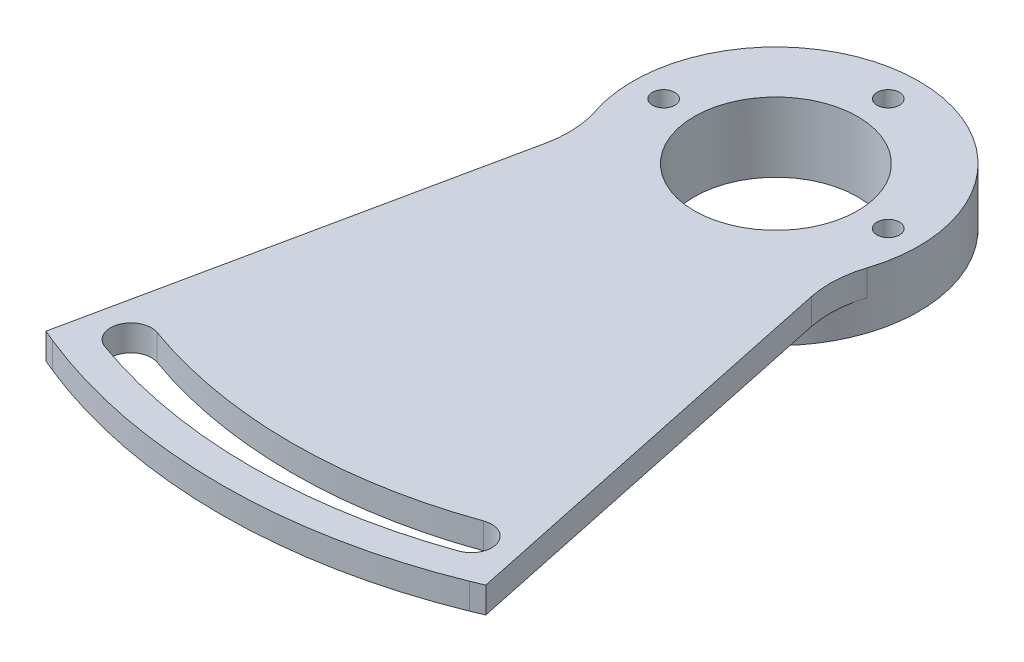
ISO-10303-21;
HEADER;
FILE_DESCRIPTION(('STEP AP214'),'2;1');
FILE_NAME('part.step','',(''),(''),'','','');
FILE_SCHEMA(('AUTOMOTIVE_DESIGN { 1 0 10303 214 1 1 1 1 }'));
ENDSEC;
DATA;
#1=APPLICATION_CONTEXT('core data for automotive mechanical design processes');
#2=APPLICATION_PROTOCOL_DEFINITION('international standard','automotive_design',2000,#1);
#3=PRODUCT_CONTEXT('',#1,'mechanical');
#4=PRODUCT('Part','Part','',(#3));
#5=PRODUCT_RELATED_PRODUCT_CATEGORY('part','',(#4));
#6=PRODUCT_DEFINITION_FORMATION('','',#4);
#7=PRODUCT_DEFINITION_CONTEXT('part definition',#1,'design');
#8=PRODUCT_DEFINITION('design','',#6,#7);
#9=PRODUCT_DEFINITION_SHAPE('','',#8);
#10=(LENGTH_UNIT() NAMED_UNIT(*) SI_UNIT(.MILLI.,.METRE.));
#11=(NAMED_UNIT(*) PLANE_ANGLE_UNIT() SI_UNIT($,.RADIAN.));
#12=(NAMED_UNIT(*) SI_UNIT($,.STERADIAN.) SOLID_ANGLE_UNIT());
#13=UNCERTAINTY_MEASURE_WITH_UNIT(LENGTH_MEASURE(1.E-05),#10,'distance_accuracy_value','');
#14=(GEOMETRIC_REPRESENTATION_CONTEXT(3) GLOBAL_UNCERTAINTY_ASSIGNED_CONTEXT((#13)) GLOBAL_UNIT_ASSIGNED_CONTEXT((#10,
#11,#12)) REPRESENTATION_CONTEXT('',''));
#15=CARTESIAN_POINT('',(0.,0.,0.));
#16=DIRECTION('',(0.,0.,1.));
#17=DIRECTION('',(1.,0.,0.));
#18=AXIS2_PLACEMENT_3D('',#15,#16,#17);
#19=CARTESIAN_POINT('',(0.,-2.999994,0.));
#20=DIRECTION('',(0.,1.,0.));
#21=DIRECTION('',(0.,0.,1.));
#22=AXIS2_PLACEMENT_3D('',#19,#20,#21);
#23=PLANE('',#22);
#24=CARTESIAN_POINT('',(0.,-2.999994,9.72130000166609));
#25=DIRECTION('',(0.,1.,0.));
#26=DIRECTION('',(0.,0.,1.));
#27=AXIS2_PLACEMENT_3D('',#24,#25,#26);
#28=CIRCLE('',#27,14.);
#29=CARTESIAN_POINT('',(0.,-2.999994,23.7213000016661));
#30=VERTEX_POINT('',#29);
#31=EDGE_CURVE('E254',#30,#30,#28,.T.);
#32=ORIENTED_EDGE('',*,*,#31,.F.);
#33=EDGE_LOOP('',(#32));
#34=FACE_BOUND('',#33,.T.);
#35=CARTESIAN_POINT('',(0.,-2.999994,-1.27869999833391));
#36=DIRECTION('',(0.,1.,0.));
#37=DIRECTION('',(0.,0.,1.));
#38=AXIS2_PLACEMENT_3D('',#35,#36,#37);
#39=CIRCLE('',#38,1.1);
#40=CARTESIAN_POINT('',(0.,-2.999994,-0.178699998333911));
#41=VERTEX_POINT('',#40);
#42=EDGE_CURVE('E336',#41,#41,#39,.T.);
#43=ORIENTED_EDGE('',*,*,#42,.T.);
#44=EDGE_LOOP('',(#43));
#45=FACE_BOUND('',#44,.T.);
#46=CARTESIAN_POINT('',(11.,-2.999994,9.72130000166609));
#47=DIRECTION('',(0.,1.,0.));
#48=DIRECTION('',(0.,0.,1.));
#49=AXIS2_PLACEMENT_3D('',#46,#47,#48);
#50=CIRCLE('',#49,1.1);
#51=CARTESIAN_POINT('',(11.,-2.999994,10.8213000016661));
#52=VERTEX_POINT('',#51);
#53=EDGE_CURVE('E333',#52,#52,#50,.T.);
#54=ORIENTED_EDGE('',*,*,#53,.T.);
#55=EDGE_LOOP('',(#54));
#56=FACE_BOUND('',#55,.T.);
#57=CARTESIAN_POINT('',(-11.,-2.999994,9.7213000016661));
#58=DIRECTION('',(0.,1.,0.));
#59=DIRECTION('',(0.,0.,1.));
#60=AXIS2_PLACEMENT_3D('',#57,#58,#59);
#61=CIRCLE('',#60,1.09999999999999);
#62=CARTESIAN_POINT('',(-11.,-2.999994,10.8213000016661));
#63=VERTEX_POINT('',#62);
#64=EDGE_CURVE('E328',#63,#63,#61,.T.);
#65=ORIENTED_EDGE('',*,*,#64,.T.);
#66=EDGE_LOOP('',(#65));
#67=FACE_BOUND('',#66,.T.);
#68=CARTESIAN_POINT('',(0.,-2.999994,9.72130000166609));
#69=DIRECTION('',(0.,1.,0.));
#70=DIRECTION('',(0.,0.,1.));
#71=AXIS2_PLACEMENT_3D('',#68,#69,#70);
#72=CIRCLE('',#71,9.);
#73=CARTESIAN_POINT('',(0.,-2.999994,18.7213000016661));
#74=VERTEX_POINT('',#73);
#75=EDGE_CURVE('E11',#74,#74,#72,.F.);
#76=ORIENTED_EDGE('',*,*,#75,.F.);
#77=EDGE_LOOP('',(#76));
#78=FACE_BOUND('',#77,.T.);
#79=ADVANCED_FACE('F34',(#34,#45,#56,#67,#78),#23,.F.);
#80=CARTESIAN_POINT('',(0.,2.54,9.72130000166609));
#81=DIRECTION('',(0.,-1.,0.));
#82=DIRECTION('',(0.,0.,-1.));
#83=AXIS2_PLACEMENT_3D('',#80,#81,#82);
#84=CYLINDRICAL_SURFACE('',#83,14.);
#85=DIRECTION('',(0.,-1.,0.));
#86=VECTOR('',#85,1.);
#87=CARTESIAN_POINT('',(13.3002264531034,2.54,14.0921095715476));
#88=LINE('',#87,#86);
#89=CARTESIAN_POINT('',(13.3002264531034,2.54,14.0921095715476));
#90=VERTEX_POINT('',#89);
#91=CARTESIAN_POINT('',(13.3002264531034,0.,14.0921095715476));
#92=VERTEX_POINT('',#91);
#93=EDGE_CURVE('E132',#90,#92,#88,.T.);
#94=ORIENTED_EDGE('',*,*,#93,.T.);
#95=CARTESIAN_POINT('',(0.,0.,9.72130000166609));
#96=DIRECTION('',(0.,1.,0.));
#97=DIRECTION('',(0.,0.,1.));
#98=AXIS2_PLACEMENT_3D('',#95,#96,#97);
#99=CIRCLE('',#98,14.);
#100=CARTESIAN_POINT('',(-13.3002264531034,0.,14.0921095715476));
#101=VERTEX_POINT('',#100);
#102=EDGE_CURVE('E42',#101,#92,#99,.T.);
#103=ORIENTED_EDGE('',*,*,#102,.F.);
#104=DIRECTION('',(0.,-1.,0.));
#105=VECTOR('',#104,1.);
#106=CARTESIAN_POINT('',(-13.3002264531034,2.54,14.0921095715476));
#107=LINE('',#106,#105);
#108=CARTESIAN_POINT('',(-13.3002264531034,2.54,14.0921095715476));
#109=VERTEX_POINT('',#108);
#110=EDGE_CURVE('E129',#101,#109,#107,.F.);
#111=ORIENTED_EDGE('',*,*,#110,.T.);
#112=CARTESIAN_POINT('',(0.,2.54,9.72130000166609));
#113=DIRECTION('',(0.,1.,0.));
#114=DIRECTION('',(0.,0.,1.));
#115=AXIS2_PLACEMENT_3D('',#112,#113,#114);
#116=CIRCLE('',#115,14.);
#117=EDGE_CURVE('E158',#90,#109,#116,.T.);
#118=ORIENTED_EDGE('',*,*,#117,.F.);
#119=EDGE_LOOP('',(#94,#103,#111,#118));
#120=FACE_BOUND('',#119,.T.);
#121=ORIENTED_EDGE('',*,*,#31,.T.);
#122=EDGE_LOOP('',(#121));
#123=FACE_BOUND('',#122,.T.);
#124=ADVANCED_FACE('F125',(#120,#123),#84,.T.);
#125=CARTESIAN_POINT('',(-8.56841564748164,2.54,-1.80723900880772));
#126=DIRECTION('',(0.978472319325836,0.,0.20637810037191));
#127=DIRECTION('',(0.20637810037191,0.,-0.978472319325837));
#128=AXIS2_PLACEMENT_3D('',#125,#126,#127);
#129=PLANE('',#128);
#130=DIRECTION('',(-0.20637810037191,0.,0.978472319325837));
#131=VECTOR('',#130,1.);
#132=CARTESIAN_POINT('',(-8.56841564748164,2.54,-1.80723900880772));
#133=LINE('',#132,#131);
#134=CARTESIAN_POINT('',(-13.0156650120618,2.54,19.2778974108964));
#135=VERTEX_POINT('',#134);
#136=CARTESIAN_POINT('',(-21.5361568841167,2.54,59.6749425858563));
#137=VERTEX_POINT('',#136);
#138=EDGE_CURVE('E162',#135,#137,#133,.T.);
#139=ORIENTED_EDGE('',*,*,#138,.F.);
#140=DIRECTION('',(0.,1.,0.));
#141=VECTOR('',#140,1.);
#142=CARTESIAN_POINT('',(-13.0156650120618,0.,19.2778974108964));
#143=LINE('',#142,#141);
#144=CARTESIAN_POINT('',(-13.0156650120618,0.,19.2778974108964));
#145=VERTEX_POINT('',#144);
#146=EDGE_CURVE('E149',#135,#145,#143,.F.);
#147=ORIENTED_EDGE('',*,*,#146,.T.);
#148=DIRECTION('',(-0.20637810037191,0.,0.978472319325837));
#149=VECTOR('',#148,1.);
#150=CARTESIAN_POINT('',(-8.56841564748164,0.,-1.80723900880772));
#151=LINE('',#150,#149);
#152=CARTESIAN_POINT('',(-21.5361568841167,0.,59.6749425858563));
#153=VERTEX_POINT('',#152);
#154=EDGE_CURVE('E139',#145,#153,#151,.T.);
#155=ORIENTED_EDGE('',*,*,#154,.T.);
#156=DIRECTION('',(0.,-1.,0.));
#157=VECTOR('',#156,1.);
#158=CARTESIAN_POINT('',(-21.5361568841167,2.54,59.6749425858563));
#159=LINE('',#158,#157);
#160=EDGE_CURVE('E285',#137,#153,#159,.T.);
#161=ORIENTED_EDGE('',*,*,#160,.F.);
#162=EDGE_LOOP('',(#139,#147,#155,#161));
#163=FACE_BOUND('',#162,.T.);
#164=ADVANCED_FACE('F180',(#163),#129,.F.);
#165=CARTESIAN_POINT('',(-24.43214967919,2.54,58.4647199158263));
#166=DIRECTION('',(0.38558134753756,0.,-0.922673845099729));
#167=DIRECTION('',(-0.922673845099729,0.,-0.38558134753756));
#168=AXIS2_PLACEMENT_3D('',#165,#166,#167);
#169=PLANE('',#168);
#170=DIRECTION('',(0.922673845099729,0.,0.38558134753756));
#171=VECTOR('',#170,1.);
#172=CARTESIAN_POINT('',(-24.43214967919,0.,58.4647199158263));
#173=LINE('',#172,#171);
#174=CARTESIAN_POINT('',(-20.4111298530471,0.,60.1450864410873));
#175=VERTEX_POINT('',#174);
#176=EDGE_CURVE('E267',#153,#175,#173,.T.);
#177=ORIENTED_EDGE('',*,*,#176,.T.);
#178=DIRECTION('',(0.,-1.,0.));
#179=VECTOR('',#178,1.);
#180=CARTESIAN_POINT('',(-20.4111298530471,2.54,60.1450864410873));
#181=LINE('',#180,#179);
#182=CARTESIAN_POINT('',(-20.4111298530471,2.54,60.1450864410873));
#183=VERTEX_POINT('',#182);
#184=EDGE_CURVE('E283',#183,#175,#181,.T.);
#185=ORIENTED_EDGE('',*,*,#184,.F.);
#186=DIRECTION('',(0.922673845099729,0.,0.38558134753756));
#187=VECTOR('',#186,1.);
#188=CARTESIAN_POINT('',(-24.43214967919,2.54,58.4647199158263));
#189=LINE('',#188,#187);
#190=EDGE_CURVE('E297',#137,#183,#189,.T.);
#191=ORIENTED_EDGE('',*,*,#190,.F.);
#192=ORIENTED_EDGE('',*,*,#160,.T.);
#193=EDGE_LOOP('',(#177,#185,#191,#192));
#194=FACE_BOUND('',#193,.T.);
#195=ADVANCED_FACE('F221',(#194),#169,.F.);
#196=CARTESIAN_POINT('',(0.,2.54,9.72130000166609));
#197=DIRECTION('',(0.,-1.,0.));
#198=DIRECTION('',(0.,0.,-1.));
#199=AXIS2_PLACEMENT_3D('',#196,#197,#198);
#200=CYLINDRICAL_SURFACE('',#199,54.3982762664986);
#201=CARTESIAN_POINT('',(0.,0.,9.72130000166609));
#202=DIRECTION('',(0.,1.,0.));
#203=DIRECTION('',(0.,0.,1.));
#204=AXIS2_PLACEMENT_3D('',#201,#202,#203);
#205=CIRCLE('',#204,54.3982762664986);
#206=CARTESIAN_POINT('',(20.4111298530471,0.,60.1450864410873));
#207=VERTEX_POINT('',#206);
#208=EDGE_CURVE('E270',#207,#175,#205,.F.);
#209=ORIENTED_EDGE('',*,*,#208,.F.);
#210=DIRECTION('',(0.,-1.,0.));
#211=VECTOR('',#210,1.);
#212=CARTESIAN_POINT('',(20.4111298530471,2.54,60.1450864410873));
#213=LINE('',#212,#211);
#214=CARTESIAN_POINT('',(20.4111298530471,2.54,60.1450864410873));
#215=VERTEX_POINT('',#214);
#216=EDGE_CURVE('E281',#215,#207,#213,.T.);
#217=ORIENTED_EDGE('',*,*,#216,.F.);
#218=CARTESIAN_POINT('',(0.,2.54,9.72130000166609));
#219=DIRECTION('',(0.,1.,0.));
#220=DIRECTION('',(0.,0.,1.));
#221=AXIS2_PLACEMENT_3D('',#218,#219,#220);
#222=CIRCLE('',#221,54.3982762664986);
#223=EDGE_CURVE('E299',#215,#183,#222,.F.);
#224=ORIENTED_EDGE('',*,*,#223,.T.);
#225=ORIENTED_EDGE('',*,*,#184,.T.);
#226=EDGE_LOOP('',(#209,#217,#224,#225));
#227=FACE_BOUND('',#226,.T.);
#228=ADVANCED_FACE('F217',(#227),#200,.T.);
#229=CARTESIAN_POINT('',(24.4321496791903,2.54,58.4647199158262));
#230=DIRECTION('',(0.385581347537565,0.,0.922673845099727));
#231=DIRECTION('',(0.922673845099727,0.,-0.385581347537565));
#232=AXIS2_PLACEMENT_3D('',#229,#230,#231);
#233=PLANE('',#232);
#234=DIRECTION('',(-0.922673845099727,0.,0.385581347537565));
#235=VECTOR('',#234,1.);
#236=CARTESIAN_POINT('',(24.4321496791903,0.,58.4647199158262));
#237=LINE('',#236,#235);
#238=CARTESIAN_POINT('',(21.5361568841167,0.,59.6749425858563));
#239=VERTEX_POINT('',#238);
#240=EDGE_CURVE('E273',#239,#207,#237,.T.);
#241=ORIENTED_EDGE('',*,*,#240,.F.);
#242=DIRECTION('',(0.,-1.,0.));
#243=VECTOR('',#242,1.);
#244=CARTESIAN_POINT('',(21.5361568841167,2.54,59.6749425858563));
#245=LINE('',#244,#243);
#246=CARTESIAN_POINT('',(21.5361568841167,2.54,59.6749425858563));
#247=VERTEX_POINT('',#246);
#248=EDGE_CURVE('E279',#247,#239,#245,.T.);
#249=ORIENTED_EDGE('',*,*,#248,.F.);
#250=DIRECTION('',(-0.922673845099727,0.,0.385581347537565));
#251=VECTOR('',#250,1.);
#252=CARTESIAN_POINT('',(24.4321496791903,2.54,58.4647199158262));
#253=LINE('',#252,#251);
#254=EDGE_CURVE('E305',#247,#215,#253,.T.);
#255=ORIENTED_EDGE('',*,*,#254,.T.);
#256=ORIENTED_EDGE('',*,*,#216,.T.);
#257=EDGE_LOOP('',(#241,#249,#255,#256));
#258=FACE_BOUND('',#257,.T.);
#259=ADVANCED_FACE('F213',(#258),#233,.T.);
#260=CARTESIAN_POINT('',(0.,2.54,9.72130000166609));
#261=DIRECTION('',(0.,-1.,0.));
#262=DIRECTION('',(0.,0.,-1.));
#263=AXIS2_PLACEMENT_3D('',#260,#261,#262);
#264=CYLINDRICAL_SURFACE('',#263,51.3982762885047);
#265=CARTESIAN_POINT('',(0.,0.,9.72130000166609));
#266=DIRECTION('',(0.,1.,0.));
#267=DIRECTION('',(0.,0.,1.));
#268=AXIS2_PLACEMENT_3D('',#265,#266,#267);
#269=CIRCLE('',#268,51.3982762885047);
#270=CARTESIAN_POINT('',(-17.3407347640808,0.,58.1060261378267));
#271=VERTEX_POINT('',#270);
#272=CARTESIAN_POINT('',(17.340734764081,0.,58.1060261378267));
#273=VERTEX_POINT('',#272);
#274=EDGE_CURVE('E245',#271,#273,#269,.T.);
#275=ORIENTED_EDGE('',*,*,#274,.F.);
#276=DIRECTION('',(0.,-1.,0.));
#277=VECTOR('',#276,1.);
#278=CARTESIAN_POINT('',(-17.3407347640808,2.54,58.1060261378267));
#279=LINE('',#278,#277);
#280=CARTESIAN_POINT('',(-17.3407347640808,2.54,58.1060261378267));
#281=VERTEX_POINT('',#280);
#282=EDGE_CURVE('E248',#281,#271,#279,.T.);
#283=ORIENTED_EDGE('',*,*,#282,.F.);
#284=CARTESIAN_POINT('',(0.,2.54,9.72130000166609));
#285=DIRECTION('',(0.,1.,0.));
#286=DIRECTION('',(0.,0.,1.));
#287=AXIS2_PLACEMENT_3D('',#284,#285,#286);
#288=CIRCLE('',#287,51.3982762885047);
#289=CARTESIAN_POINT('',(17.340734764081,2.54,58.1060261378267));
#290=VERTEX_POINT('',#289);
#291=EDGE_CURVE('E278',#281,#290,#288,.T.);
#292=ORIENTED_EDGE('',*,*,#291,.T.);
#293=DIRECTION('',(0.,-1.,0.));
#294=VECTOR('',#293,1.);
#295=CARTESIAN_POINT('',(17.340734764081,2.54,58.1060261378267));
#296=LINE('',#295,#294);
#297=EDGE_CURVE('E250',#290,#273,#296,.T.);
#298=ORIENTED_EDGE('',*,*,#297,.T.);
#299=EDGE_LOOP('',(#275,#283,#292,#298));
#300=FACE_BOUND('',#299,.T.);
#301=ADVANCED_FACE('F216',(#300),#264,.F.);
#302=CARTESIAN_POINT('',(-16.6659753937199,2.54,56.2232888843658));
#303=DIRECTION('',(0.,-1.,0.));
#304=DIRECTION('',(0.,0.,-1.));
#305=AXIS2_PLACEMENT_3D('',#302,#303,#304);
#306=CYLINDRICAL_SURFACE('',#305,1.99999994336487);
#307=CARTESIAN_POINT('',(-16.6659753937199,0.,56.2232888843658));
#308=DIRECTION('',(0.,1.,0.));
#309=DIRECTION('',(0.,0.,1.));
#310=AXIS2_PLACEMENT_3D('',#307,#308,#309);
#311=CIRCLE('',#310,1.99999994336487);
#312=CARTESIAN_POINT('',(-15.991216023359,0.,54.3405516309048));
#313=VERTEX_POINT('',#312);
#314=EDGE_CURVE('E253',#313,#271,#311,.T.);
#315=ORIENTED_EDGE('',*,*,#314,.F.);
#316=DIRECTION('',(0.,-1.,0.));
#317=VECTOR('',#316,1.);
#318=CARTESIAN_POINT('',(-15.991216023359,2.54,54.3405516309048));
#319=LINE('',#318,#317);
#320=CARTESIAN_POINT('',(-15.991216023359,2.54,54.3405516309048));
#321=VERTEX_POINT('',#320);
#322=EDGE_CURVE('E292',#321,#313,#319,.T.);
#323=ORIENTED_EDGE('',*,*,#322,.F.);
#324=CARTESIAN_POINT('',(-16.6659753937199,2.54,56.2232888843658));
#325=DIRECTION('',(0.,1.,0.));
#326=DIRECTION('',(0.,0.,1.));
#327=AXIS2_PLACEMENT_3D('',#324,#325,#326);
#328=CIRCLE('',#327,1.99999994336487);
#329=EDGE_CURVE('E342',#321,#281,#328,.T.);
#330=ORIENTED_EDGE('',*,*,#329,.T.);
#331=ORIENTED_EDGE('',*,*,#282,.T.);
#332=EDGE_LOOP('',(#315,#323,#330,#331));
#333=FACE_BOUND('',#332,.T.);
#334=ADVANCED_FACE('F234',(#333),#306,.F.);
#335=CARTESIAN_POINT('',(0.,2.54,9.72130000166609));
#336=DIRECTION('',(0.,-1.,0.));
#337=DIRECTION('',(0.,0.,-1.));
#338=AXIS2_PLACEMENT_3D('',#335,#336,#337);
#339=CYLINDRICAL_SURFACE('',#338,47.398276401775);
#340=CARTESIAN_POINT('',(0.,0.,9.72130000166609));
#341=DIRECTION('',(0.,1.,0.));
#342=DIRECTION('',(0.,0.,1.));
#343=AXIS2_PLACEMENT_3D('',#340,#341,#342);
#344=CIRCLE('',#343,47.398276401775);
#345=CARTESIAN_POINT('',(15.9912160233592,0.,54.3405516309047));
#346=VERTEX_POINT('',#345);
#347=EDGE_CURVE('E259',#346,#313,#344,.F.);
#348=ORIENTED_EDGE('',*,*,#347,.F.);
#349=DIRECTION('',(0.,-1.,0.));
#350=VECTOR('',#349,1.);
#351=CARTESIAN_POINT('',(15.9912160233592,2.54,54.3405516309047));
#352=LINE('',#351,#350);
#353=CARTESIAN_POINT('',(15.9912160233592,2.54,54.3405516309047));
#354=VERTEX_POINT('',#353);
#355=EDGE_CURVE('E289',#354,#346,#352,.T.);
#356=ORIENTED_EDGE('',*,*,#355,.F.);
#357=CARTESIAN_POINT('',(0.,2.54,9.72130000166609));
#358=DIRECTION('',(0.,1.,0.));
#359=DIRECTION('',(0.,0.,1.));
#360=AXIS2_PLACEMENT_3D('',#357,#358,#359);
#361=CIRCLE('',#360,47.398276401775);
#362=EDGE_CURVE('E345',#354,#321,#361,.F.);
#363=ORIENTED_EDGE('',*,*,#362,.T.);
#364=ORIENTED_EDGE('',*,*,#322,.T.);
#365=EDGE_LOOP('',(#348,#356,#363,#364));
#366=FACE_BOUND('',#365,.T.);
#367=ADVANCED_FACE('F201',(#366),#339,.T.);
#368=CARTESIAN_POINT('',(0.,2.54,-1.27869999833391));
#369=DIRECTION('',(0.,-1.,0.));
#370=DIRECTION('',(0.,0.,-1.));
#371=AXIS2_PLACEMENT_3D('',#368,#369,#370);
#372=CYLINDRICAL_SURFACE('',#371,1.1);
#373=CARTESIAN_POINT('',(0.,2.54,-1.27869999833391));
#374=DIRECTION('',(0.,1.,0.));
#375=DIRECTION('',(0.,0.,1.));
#376=AXIS2_PLACEMENT_3D('',#373,#374,#375);
#377=CIRCLE('',#376,1.1);
#378=CARTESIAN_POINT('',(0.,2.54,-0.178699998333911));
#379=VERTEX_POINT('',#378);
#380=EDGE_CURVE('E315',#379,#379,#377,.T.);
#381=ORIENTED_EDGE('',*,*,#380,.T.);
#382=EDGE_LOOP('',(#381));
#383=FACE_BOUND('',#382,.T.);
#384=ORIENTED_EDGE('',*,*,#42,.F.);
#385=EDGE_LOOP('',(#384));
#386=FACE_BOUND('',#385,.T.);
#387=ADVANCED_FACE('F197',(#383,#386),#372,.F.);
#388=CARTESIAN_POINT('',(11.,2.54,9.72130000166609));
#389=DIRECTION('',(0.,-1.,0.));
#390=DIRECTION('',(0.,0.,-1.));
#391=AXIS2_PLACEMENT_3D('',#388,#389,#390);
#392=CYLINDRICAL_SURFACE('',#391,1.1);
#393=CARTESIAN_POINT('',(11.,2.54,9.72130000166609));
#394=DIRECTION('',(0.,1.,0.));
#395=DIRECTION('',(0.,0.,1.));
#396=AXIS2_PLACEMENT_3D('',#393,#394,#395);
#397=CIRCLE('',#396,1.1);
#398=CARTESIAN_POINT('',(11.,2.54,10.8213000016661));
#399=VERTEX_POINT('',#398);
#400=EDGE_CURVE('E312',#399,#399,#397,.T.);
#401=ORIENTED_EDGE('',*,*,#400,.T.);
#402=EDGE_LOOP('',(#401));
#403=FACE_BOUND('',#402,.T.);
#404=ORIENTED_EDGE('',*,*,#53,.F.);
#405=EDGE_LOOP('',(#404));
#406=FACE_BOUND('',#405,.T.);
#407=ADVANCED_FACE('F200',(#403,#406),#392,.F.);
#408=CARTESIAN_POINT('',(-11.,2.54,9.7213000016661));
#409=DIRECTION('',(0.,-1.,0.));
#410=DIRECTION('',(0.,0.,-1.));
#411=AXIS2_PLACEMENT_3D('',#408,#409,#410);
#412=CYLINDRICAL_SURFACE('',#411,1.09999999999999);
#413=CARTESIAN_POINT('',(-11.,2.54,9.7213000016661));
#414=DIRECTION('',(0.,1.,0.));
#415=DIRECTION('',(0.,0.,1.));
#416=AXIS2_PLACEMENT_3D('',#413,#414,#415);
#417=CIRCLE('',#416,1.09999999999999);
#418=CARTESIAN_POINT('',(-11.,2.54,10.8213000016661));
#419=VERTEX_POINT('',#418);
#420=EDGE_CURVE('E309',#419,#419,#417,.T.);
#421=ORIENTED_EDGE('',*,*,#420,.T.);
#422=EDGE_LOOP('',(#421));
#423=FACE_BOUND('',#422,.T.);
#424=ORIENTED_EDGE('',*,*,#64,.F.);
#425=EDGE_LOOP('',(#424));
#426=FACE_BOUND('',#425,.T.);
#427=ADVANCED_FACE('F205',(#423,#426),#412,.F.);
#428=CARTESIAN_POINT('',(8.56841564748165,2.54,-1.80723900880772));
#429=DIRECTION('',(-0.978472319325837,0.,0.20637810037191));
#430=DIRECTION('',(0.20637810037191,0.,0.978472319325837));
#431=AXIS2_PLACEMENT_3D('',#428,#429,#430);
#432=PLANE('',#431);
#433=DIRECTION('',(-0.20637810037191,0.,-0.978472319325837));
#434=VECTOR('',#433,1.);
#435=CARTESIAN_POINT('',(8.56841564748165,0.,-1.80723900880772));
#436=LINE('',#435,#434);
#437=CARTESIAN_POINT('',(13.0156650120618,0.,19.2778974108963));
#438=VERTEX_POINT('',#437);
#439=EDGE_CURVE('E276',#239,#438,#436,.T.);
#440=ORIENTED_EDGE('',*,*,#439,.T.);
#441=DIRECTION('',(0.,1.,0.));
#442=VECTOR('',#441,1.);
#443=CARTESIAN_POINT('',(13.0156650120618,2.54,19.2778974108963));
#444=LINE('',#443,#442);
#445=CARTESIAN_POINT('',(13.0156650120618,2.54,19.2778974108963));
#446=VERTEX_POINT('',#445);
#447=EDGE_CURVE('E49',#438,#446,#444,.T.);
#448=ORIENTED_EDGE('',*,*,#447,.T.);
#449=DIRECTION('',(-0.20637810037191,0.,-0.978472319325837));
#450=VECTOR('',#449,1.);
#451=CARTESIAN_POINT('',(8.56841564748165,2.54,-1.80723900880772));
#452=LINE('',#451,#450);
#453=EDGE_CURVE('E160',#247,#446,#452,.T.);
#454=ORIENTED_EDGE('',*,*,#453,.F.);
#455=ORIENTED_EDGE('',*,*,#248,.T.);
#456=EDGE_LOOP('',(#440,#448,#454,#455));
#457=FACE_BOUND('',#456,.T.);
#458=ADVANCED_FACE('F209',(#457),#432,.F.);
#459=CARTESIAN_POINT('',(16.6659753937201,2.54,56.2232888843657));
#460=DIRECTION('',(0.,-1.,0.));
#461=DIRECTION('',(0.,0.,-1.));
#462=AXIS2_PLACEMENT_3D('',#459,#460,#461);
#463=CYLINDRICAL_SURFACE('',#462,1.99999994336488);
#464=CARTESIAN_POINT('',(16.6659753937201,0.,56.2232888843657));
#465=DIRECTION('',(0.,1.,0.));
#466=DIRECTION('',(0.,0.,1.));
#467=AXIS2_PLACEMENT_3D('',#464,#465,#466);
#468=CIRCLE('',#467,1.99999994336488);
#469=EDGE_CURVE('E261',#273,#346,#468,.T.);
#470=ORIENTED_EDGE('',*,*,#469,.F.);
#471=ORIENTED_EDGE('',*,*,#297,.F.);
#472=CARTESIAN_POINT('',(16.6659753937201,2.54,56.2232888843657));
#473=DIRECTION('',(0.,1.,0.));
#474=DIRECTION('',(0.,0.,1.));
#475=AXIS2_PLACEMENT_3D('',#472,#473,#474);
#476=CIRCLE('',#475,1.99999994336488);
#477=EDGE_CURVE('E163',#290,#354,#476,.T.);
#478=ORIENTED_EDGE('',*,*,#477,.T.);
#479=ORIENTED_EDGE('',*,*,#355,.T.);
#480=EDGE_LOOP('',(#470,#471,#478,#479));
#481=FACE_BOUND('',#480,.T.);
#482=ADVANCED_FACE('F195',(#481),#463,.F.);
#483=CARTESIAN_POINT('',(0.,2.54,9.72130000166609));
#484=DIRECTION('',(0.,-1.,0.));
#485=DIRECTION('',(0.,0.,-1.));
#486=AXIS2_PLACEMENT_3D('',#483,#484,#485);
#487=CYLINDRICAL_SURFACE('',#486,8.00000000000001);
#488=CARTESIAN_POINT('',(0.,2.54,9.72130000166609));
#489=DIRECTION('',(0.,1.,0.));
#490=DIRECTION('',(0.,0.,1.));
#491=AXIS2_PLACEMENT_3D('',#488,#489,#490);
#492=CIRCLE('',#491,8.00000000000001);
#493=CARTESIAN_POINT('',(0.,2.54,17.7213000016661));
#494=VERTEX_POINT('',#493);
#495=EDGE_CURVE('E290',#494,#494,#492,.F.);
#496=ORIENTED_EDGE('',*,*,#495,.F.);
#497=EDGE_LOOP('',(#496));
#498=FACE_BOUND('',#497,.T.);
#499=CARTESIAN_POINT('',(0.,-4.269994,9.72130000166609));
#500=DIRECTION('',(0.,-1.,0.));
#501=DIRECTION('',(0.,0.,-1.));
#502=AXIS2_PLACEMENT_3D('',#499,#500,#501);
#503=CIRCLE('',#502,8.00000000000001);
#504=CARTESIAN_POINT('',(0.,-4.269994,1.72130000166609));
#505=VERTEX_POINT('',#504);
#506=EDGE_CURVE('E323',#505,#505,#503,.T.);
#507=ORIENTED_EDGE('',*,*,#506,.T.);
#508=EDGE_LOOP('',(#507));
#509=FACE_BOUND('',#508,.T.);
#510=ADVANCED_FACE('F188',(#498,#509),#487,.F.);
#511=CARTESIAN_POINT('',(0.,2.54,0.));
#512=DIRECTION('',(0.,1.,0.));
#513=DIRECTION('',(0.,0.,1.));
#514=AXIS2_PLACEMENT_3D('',#511,#512,#513);
#515=PLANE('',#514);
#516=ORIENTED_EDGE('',*,*,#291,.F.);
#517=ORIENTED_EDGE('',*,*,#329,.F.);
#518=ORIENTED_EDGE('',*,*,#362,.F.);
#519=ORIENTED_EDGE('',*,*,#477,.F.);
#520=EDGE_LOOP('',(#516,#517,#518,#519));
#521=FACE_BOUND('',#520,.T.);
#522=ORIENTED_EDGE('',*,*,#453,.T.);
#523=CARTESIAN_POINT('',(22.8003882053202,2.54,17.2141164071772));
#524=DIRECTION('',(0.,1.,0.));
#525=DIRECTION('',(0.,0.,1.));
#526=AXIS2_PLACEMENT_3D('',#523,#524,#525);
#527=CIRCLE('',#526,10.);
#528=EDGE_CURVE('E133',#446,#90,#527,.F.);
#529=ORIENTED_EDGE('',*,*,#528,.T.);
#530=ORIENTED_EDGE('',*,*,#117,.T.);
#531=CARTESIAN_POINT('',(-22.8003882053202,2.54,17.2141164071773));
#532=DIRECTION('',(0.,1.,0.));
#533=DIRECTION('',(0.,0.,1.));
#534=AXIS2_PLACEMENT_3D('',#531,#532,#533);
#535=CIRCLE('',#534,10.);
#536=EDGE_CURVE('E143',#109,#135,#535,.F.);
#537=ORIENTED_EDGE('',*,*,#536,.T.);
#538=ORIENTED_EDGE('',*,*,#138,.T.);
#539=ORIENTED_EDGE('',*,*,#190,.T.);
#540=ORIENTED_EDGE('',*,*,#223,.F.);
#541=ORIENTED_EDGE('',*,*,#254,.F.);
#542=EDGE_LOOP('',(#522,#529,#530,#537,#538,#539,#540,#541));
#543=FACE_BOUND('',#542,.T.);
#544=ORIENTED_EDGE('',*,*,#420,.F.);
#545=EDGE_LOOP('',(#544));
#546=FACE_BOUND('',#545,.T.);
#547=ORIENTED_EDGE('',*,*,#400,.F.);
#548=EDGE_LOOP('',(#547));
#549=FACE_BOUND('',#548,.T.);
#550=ORIENTED_EDGE('',*,*,#380,.F.);
#551=EDGE_LOOP('',(#550));
#552=FACE_BOUND('',#551,.T.);
#553=ORIENTED_EDGE('',*,*,#495,.T.);
#554=EDGE_LOOP('',(#553));
#555=FACE_BOUND('',#554,.T.);
#556=ADVANCED_FACE('F156',(#521,#543,#546,#549,#552,#555),#515,.T.);
#557=CARTESIAN_POINT('',(0.,0.,0.));
#558=DIRECTION('',(0.,1.,0.));
#559=DIRECTION('',(0.,0.,1.));
#560=AXIS2_PLACEMENT_3D('',#557,#558,#559);
#561=PLANE('',#560);
#562=ORIENTED_EDGE('',*,*,#274,.T.);
#563=ORIENTED_EDGE('',*,*,#469,.T.);
#564=ORIENTED_EDGE('',*,*,#347,.T.);
#565=ORIENTED_EDGE('',*,*,#314,.T.);
#566=EDGE_LOOP('',(#562,#563,#564,#565));
#567=FACE_BOUND('',#566,.T.);
#568=CARTESIAN_POINT('',(-22.8003882053202,0.,17.2141164071773));
#569=DIRECTION('',(0.,1.,0.));
#570=DIRECTION('',(0.,0.,1.));
#571=AXIS2_PLACEMENT_3D('',#568,#569,#570);
#572=CIRCLE('',#571,10.);
#573=EDGE_CURVE('E136',#145,#101,#572,.T.);
#574=ORIENTED_EDGE('',*,*,#573,.T.);
#575=ORIENTED_EDGE('',*,*,#102,.T.);
#576=CARTESIAN_POINT('',(22.8003882053202,0.,17.2141164071772));
#577=DIRECTION('',(0.,1.,0.));
#578=DIRECTION('',(0.,0.,1.));
#579=AXIS2_PLACEMENT_3D('',#576,#577,#578);
#580=CIRCLE('',#579,10.);
#581=EDGE_CURVE('E57',#92,#438,#580,.T.);
#582=ORIENTED_EDGE('',*,*,#581,.T.);
#583=ORIENTED_EDGE('',*,*,#439,.F.);
#584=ORIENTED_EDGE('',*,*,#240,.T.);
#585=ORIENTED_EDGE('',*,*,#208,.T.);
#586=ORIENTED_EDGE('',*,*,#176,.F.);
#587=ORIENTED_EDGE('',*,*,#154,.F.);
#588=EDGE_LOOP('',(#574,#575,#582,#583,#584,#585,#586,#587));
#589=FACE_BOUND('',#588,.T.);
#590=ADVANCED_FACE('F137',(#567,#589),#561,.F.);
#591=CARTESIAN_POINT('',(-22.8003882053202,2.54,17.2141164071773));
#592=DIRECTION('',(0.,-1.,0.));
#593=DIRECTION('',(0.,0.,-1.));
#594=AXIS2_PLACEMENT_3D('',#591,#592,#593);
#595=CYLINDRICAL_SURFACE('',#594,10.);
#596=ORIENTED_EDGE('',*,*,#536,.F.);
#597=ORIENTED_EDGE('',*,*,#110,.F.);
#598=ORIENTED_EDGE('',*,*,#573,.F.);
#599=ORIENTED_EDGE('',*,*,#146,.F.);
#600=EDGE_LOOP('',(#596,#597,#598,#599));
#601=FACE_BOUND('',#600,.T.);
#602=ADVANCED_FACE('F146',(#601),#595,.F.);
#603=CARTESIAN_POINT('',(22.8003882053202,2.54,17.2141164071772));
#604=DIRECTION('',(0.,-1.,0.));
#605=DIRECTION('',(0.,0.,-1.));
#606=AXIS2_PLACEMENT_3D('',#603,#604,#605);
#607=CYLINDRICAL_SURFACE('',#606,10.);
#608=ORIENTED_EDGE('',*,*,#528,.F.);
#609=ORIENTED_EDGE('',*,*,#447,.F.);
#610=ORIENTED_EDGE('',*,*,#581,.F.);
#611=ORIENTED_EDGE('',*,*,#93,.F.);
#612=EDGE_LOOP('',(#608,#609,#610,#611));
#613=FACE_BOUND('',#612,.T.);
#614=ADVANCED_FACE('F36',(#613),#607,.F.);
#615=CARTESIAN_POINT('',(0.,-4.269994,9.72130000166609));
#616=DIRECTION('',(0.,-1.,0.));
#617=DIRECTION('',(0.,0.,-1.));
#618=AXIS2_PLACEMENT_3D('',#615,#616,#617);
#619=PLANE('',#618);
#620=CARTESIAN_POINT('',(0.,-4.269994,9.72130000166609));
#621=DIRECTION('',(0.,-1.,0.));
#622=DIRECTION('',(0.,0.,-1.));
#623=AXIS2_PLACEMENT_3D('',#620,#621,#622);
#624=CIRCLE('',#623,9.);
#625=CARTESIAN_POINT('',(0.,-4.269994,0.721300001666094));
#626=VERTEX_POINT('',#625);
#627=EDGE_CURVE('E325',#626,#626,#624,.T.);
#628=ORIENTED_EDGE('',*,*,#627,.T.);
#629=EDGE_LOOP('',(#628));
#630=FACE_BOUND('',#629,.T.);
#631=ORIENTED_EDGE('',*,*,#506,.F.);
#632=EDGE_LOOP('',(#631));
#633=FACE_BOUND('',#632,.T.);
#634=ADVANCED_FACE('F166',(#630,#633),#619,.T.);
#635=CARTESIAN_POINT('',(0.,-4.269994,9.72130000166609));
#636=DIRECTION('',(0.,1.,0.));
#637=DIRECTION('',(0.,0.,1.));
#638=AXIS2_PLACEMENT_3D('',#635,#636,#637);
#639=CYLINDRICAL_SURFACE('',#638,9.);
#640=ORIENTED_EDGE('',*,*,#627,.F.);
#641=EDGE_LOOP('',(#640));
#642=FACE_BOUND('',#641,.T.);
#643=ORIENTED_EDGE('',*,*,#75,.T.);
#644=EDGE_LOOP('',(#643));
#645=FACE_BOUND('',#644,.T.);
#646=ADVANCED_FACE('F171',(#642,#645),#639,.T.);
#647=CLOSED_SHELL('',(#79,#124,#164,#195,#228,#259,#301,#334,#367,#387,#407,#427,#458,#482,#510,
#556,#590,#602,#614,#634,#646));
#648=MANIFOLD_SOLID_BREP('B2',#647);
#649=ADVANCED_BREP_SHAPE_REPRESENTATION('',(#18,#648),#14);
#650=SHAPE_DEFINITION_REPRESENTATION(#9,#649);
ENDSEC;
END-ISO-10303-21;
